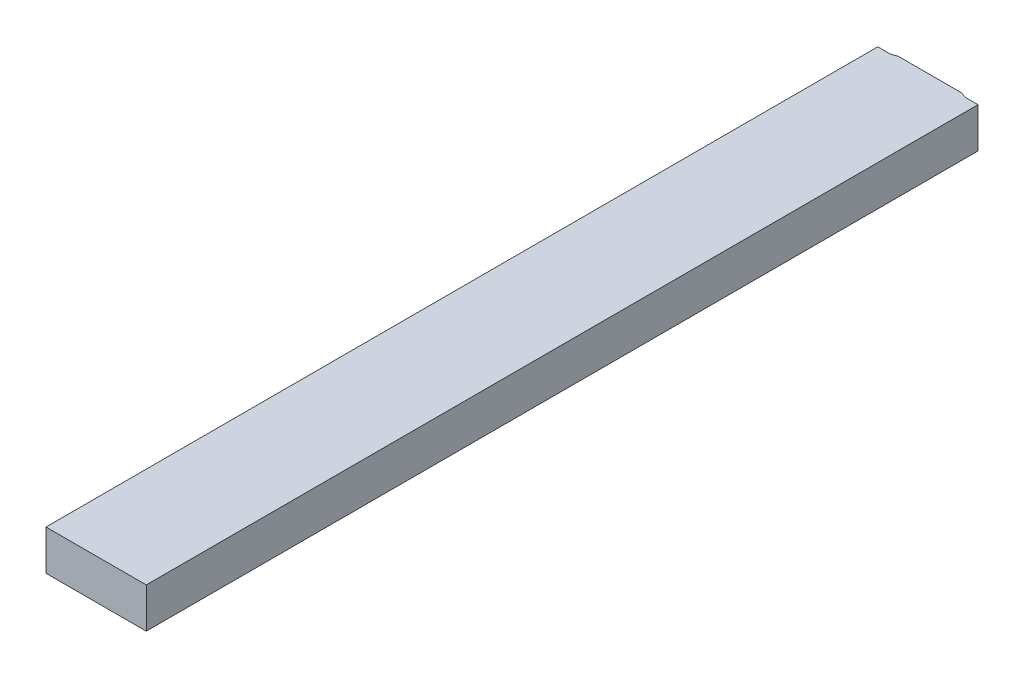
ISO-10303-21;
HEADER;
FILE_DESCRIPTION(('STEP AP214'),'2;1');
FILE_NAME('part.step','',(''),(''),'','','');
FILE_SCHEMA(('AUTOMOTIVE_DESIGN { 1 0 10303 214 1 1 1 1 }'));
ENDSEC;
DATA;
#1=APPLICATION_CONTEXT('core data for automotive mechanical design processes');
#2=APPLICATION_PROTOCOL_DEFINITION('international standard','automotive_design',2000,#1);
#3=PRODUCT_CONTEXT('',#1,'mechanical');
#4=PRODUCT('Part','Part','',(#3));
#5=PRODUCT_RELATED_PRODUCT_CATEGORY('part','',(#4));
#6=PRODUCT_DEFINITION_FORMATION('','',#4);
#7=PRODUCT_DEFINITION_CONTEXT('part definition',#1,'design');
#8=PRODUCT_DEFINITION('design','',#6,#7);
#9=PRODUCT_DEFINITION_SHAPE('','',#8);
#10=(LENGTH_UNIT() NAMED_UNIT(*) SI_UNIT(.MILLI.,.METRE.));
#11=(NAMED_UNIT(*) PLANE_ANGLE_UNIT() SI_UNIT($,.RADIAN.));
#12=(NAMED_UNIT(*) SI_UNIT($,.STERADIAN.) SOLID_ANGLE_UNIT());
#13=UNCERTAINTY_MEASURE_WITH_UNIT(LENGTH_MEASURE(1.E-05),#10,'distance_accuracy_value','');
#14=(GEOMETRIC_REPRESENTATION_CONTEXT(3) GLOBAL_UNCERTAINTY_ASSIGNED_CONTEXT((#13)) GLOBAL_UNIT_ASSIGNED_CONTEXT((#10,
#11,#12)) REPRESENTATION_CONTEXT('',''));
#15=CARTESIAN_POINT('',(0.,0.,0.));
#16=DIRECTION('',(0.,0.,1.));
#17=DIRECTION('',(1.,0.,0.));
#18=AXIS2_PLACEMENT_3D('',#15,#16,#17);
#19=CARTESIAN_POINT('',(-3.5,0.275,-4.982138483572));
#20=DIRECTION('',(0.,1.,0.));
#21=DIRECTION('',(0.,0.,1.));
#22=AXIS2_PLACEMENT_3D('',#19,#20,#21);
#23=PLANE('',#22);
#24=DIRECTION('',(1.,0.,0.));
#25=VECTOR('',#24,1.);
#26=CARTESIAN_POINT('',(-3.725,0.275,-7.051158663985));
#27=LINE('',#26,#25);
#28=CARTESIAN_POINT('',(-3.75,0.275,-7.051158663985));
#29=VERTEX_POINT('',#28);
#30=CARTESIAN_POINT('',(-3.69999999999826,0.275,-7.05115866398515));
#31=VERTEX_POINT('',#30);
#32=EDGE_CURVE('E184',#29,#31,#27,.T.);
#33=ORIENTED_EDGE('',*,*,#32,.T.);
#34=CARTESIAN_POINT('',(-3.66074390617903,0.275,-7.06145062487903));
#35=CARTESIAN_POINT('',(-3.66430562065387,0.275,-7.05943829430754));
#36=CARTESIAN_POINT('',(-3.66802308541288,0.275,-7.05770911016996));
#37=CARTESIAN_POINT('',(-3.675678668398,0.275,-7.05483826908998));
#38=CARTESIAN_POINT('',(-3.67961678669287,0.275,-7.05369661233063));
#39=CARTESIAN_POINT('',(-3.68899940611308,0.275,-7.05173413514556));
#40=CARTESIAN_POINT('',(-3.6944962200161,0.275,-7.05115865434742));
#41=CARTESIAN_POINT('',(-3.69999999999652,0.275,-7.0511586639853));
#42=B_SPLINE_CURVE_WITH_KNOTS('',3,(#34,#35,#36,#37,#38,#39,#40,#41),.UNSPECIFIED.,.F.,.F.,(4,2,
2,4),(0.,0.0122542009828671,0.0245084057837977,0.0409766482847963),.UNSPECIFIED.);
#43=CARTESIAN_POINT('',(-3.66074390617903,0.275,-7.06145062487903));
#44=VERTEX_POINT('',#43);
#45=EDGE_CURVE('E93',#44,#31,#42,.T.);
#46=ORIENTED_EDGE('',*,*,#45,.F.);
#47=DIRECTION('',(1.,0.,0.));
#48=VECTOR('',#47,1.);
#49=CARTESIAN_POINT('',(-3.499999951796,0.275,-7.061450624879));
#50=LINE('',#49,#48);
#51=CARTESIAN_POINT('',(-3.339255997412,0.275,-7.06145062487899));
#52=VERTEX_POINT('',#51);
#53=EDGE_CURVE('E89',#44,#52,#50,.T.);
#54=ORIENTED_EDGE('',*,*,#53,.T.);
#55=CARTESIAN_POINT('',(-3.30000000000351,0.275,-7.05115866398509));
#56=CARTESIAN_POINT('',(-3.30408879277278,0.275,-7.05116284562048));
#57=CARTESIAN_POINT('',(-3.30817611333355,0.275,-7.05148113218099));
#58=CARTESIAN_POINT('',(-3.31625667415824,0.275,-7.05273057454798));
#59=CARTESIAN_POINT('',(-3.32024989952299,0.275,-7.05366182674584));
#60=CARTESIAN_POINT('',(-3.32939082766556,0.275,-7.05654480111922));
#61=CARTESIAN_POINT('',(-3.33446335028937,0.275,-7.05873731135742));
#62=CARTESIAN_POINT('',(-3.339255997412,0.275,-7.06145062487899));
#63=B_SPLINE_CURVE_WITH_KNOTS('',3,(#55,#56,#57,#58,#59,#60,#61,#62),.UNSPECIFIED.,.F.,.F.,(4,2,
2,4),(0.,0.0122527379750514,0.0245074032044955,0.0409759652394006),.UNSPECIFIED.);
#64=CARTESIAN_POINT('',(-3.30000000000176,0.275,-7.05115866398504));
#65=VERTEX_POINT('',#64);
#66=EDGE_CURVE('E21',#65,#52,#63,.T.);
#67=ORIENTED_EDGE('',*,*,#66,.F.);
#68=DIRECTION('',(1.,0.,0.));
#69=VECTOR('',#68,1.);
#70=CARTESIAN_POINT('',(-3.275,0.275,-7.051158663985));
#71=LINE('',#70,#69);
#72=CARTESIAN_POINT('',(-3.25,0.275,-7.051158663985));
#73=VERTEX_POINT('',#72);
#74=EDGE_CURVE('E84',#65,#73,#71,.T.);
#75=ORIENTED_EDGE('',*,*,#74,.T.);
#76=DIRECTION('',(0.,0.,-1.));
#77=VECTOR('',#76,1.);
#78=CARTESIAN_POINT('',(-3.25,0.275,-4.976992503125));
#79=LINE('',#78,#77);
#80=CARTESIAN_POINT('',(-3.25,0.275,-2.902826342264));
#81=VERTEX_POINT('',#80);
#82=EDGE_CURVE('E218',#81,#73,#79,.T.);
#83=ORIENTED_EDGE('',*,*,#82,.F.);
#84=DIRECTION('',(1.,0.,0.));
#85=VECTOR('',#84,1.);
#86=CARTESIAN_POINT('',(-3.5,0.275,-2.902826342264));
#87=LINE('',#86,#85);
#88=CARTESIAN_POINT('',(-3.75,0.275,-2.902826342264));
#89=VERTEX_POINT('',#88);
#90=EDGE_CURVE('E204',#89,#81,#87,.T.);
#91=ORIENTED_EDGE('',*,*,#90,.F.);
#92=DIRECTION('',(0.,0.,-1.));
#93=VECTOR('',#92,1.);
#94=CARTESIAN_POINT('',(-3.75,0.275,-4.976992503125));
#95=LINE('',#94,#93);
#96=EDGE_CURVE('E176',#89,#29,#95,.T.);
#97=ORIENTED_EDGE('',*,*,#96,.T.);
#98=EDGE_LOOP('',(#33,#46,#54,#67,#75,#83,#91,#97));
#99=FACE_BOUND('',#98,.T.);
#100=ADVANCED_FACE('F17',(#99),#23,.F.);
#101=CARTESIAN_POINT('',(-3.25,0.375,-4.976992503125));
#102=DIRECTION('',(1.,0.,0.));
#103=DIRECTION('',(0.,0.,-1.));
#104=AXIS2_PLACEMENT_3D('',#101,#102,#103);
#105=PLANE('',#104);
#106=DIRECTION('',(0.,0.,1.));
#107=VECTOR('',#106,1.);
#108=CARTESIAN_POINT('',(-3.25,0.475,-4.982138483571));
#109=LINE('',#108,#107);
#110=CARTESIAN_POINT('',(-3.25,0.475,-2.902826342264));
#111=VERTEX_POINT('',#110);
#112=CARTESIAN_POINT('',(-3.25,0.475,-7.051158663985));
#113=VERTEX_POINT('',#112);
#114=EDGE_CURVE('E189',#111,#113,#109,.F.);
#115=ORIENTED_EDGE('',*,*,#114,.F.);
#116=DIRECTION('',(0.,1.,0.));
#117=VECTOR('',#116,1.);
#118=CARTESIAN_POINT('',(-3.25,0.375,-2.902826342264));
#119=LINE('',#118,#117);
#120=EDGE_CURVE('E203',#81,#111,#119,.T.);
#121=ORIENTED_EDGE('',*,*,#120,.F.);
#122=ORIENTED_EDGE('',*,*,#82,.T.);
#123=DIRECTION('',(0.,1.,0.));
#124=VECTOR('',#123,1.);
#125=CARTESIAN_POINT('',(-3.25,0.375,-7.051158663985));
#126=LINE('',#125,#124);
#127=EDGE_CURVE('E233',#73,#113,#126,.T.);
#128=ORIENTED_EDGE('',*,*,#127,.T.);
#129=EDGE_LOOP('',(#115,#121,#122,#128));
#130=FACE_BOUND('',#129,.T.);
#131=ADVANCED_FACE('F238',(#130),#105,.T.);
#132=CARTESIAN_POINT('',(-3.275,0.375,-7.051158663985));
#133=DIRECTION('',(0.,0.,1.));
#134=DIRECTION('',(1.,0.,0.));
#135=AXIS2_PLACEMENT_3D('',#132,#133,#134);
#136=PLANE('',#135);
#137=DIRECTION('',(1.,0.,0.));
#138=VECTOR('',#137,1.);
#139=CARTESIAN_POINT('',(-3.5,0.475,-7.051158663985));
#140=LINE('',#139,#138);
#141=CARTESIAN_POINT('',(-3.30000007335933,0.475,-7.05115866418437));
#142=VERTEX_POINT('',#141);
#143=EDGE_CURVE('E135',#113,#142,#140,.F.);
#144=ORIENTED_EDGE('',*,*,#143,.F.);
#145=ORIENTED_EDGE('',*,*,#127,.F.);
#146=ORIENTED_EDGE('',*,*,#74,.F.);
#147=DIRECTION('',(0.,1.,0.));
#148=VECTOR('',#147,1.);
#149=CARTESIAN_POINT('',(-3.3,0.2699679840491,-7.05115866398508));
#150=LINE('',#149,#148);
#151=EDGE_CURVE('E103',#142,#65,#150,.F.);
#152=ORIENTED_EDGE('',*,*,#151,.F.);
#153=EDGE_LOOP('',(#144,#145,#146,#152));
#154=FACE_BOUND('',#153,.T.);
#155=ADVANCED_FACE('F125',(#154),#136,.F.);
#156=CARTESIAN_POINT('',(-3.29748039058,0.2699679840491,-7.051190309039));
#157=CARTESIAN_POINT('',(-3.29831958238,0.2699679840491,-7.051166943388));
#158=CARTESIAN_POINT('',(-3.304384997637,0.2699679840491,-7.051090682037));
#159=CARTESIAN_POINT('',(-3.315708586206,0.2699679840491,-7.052195104335));
#160=CARTESIAN_POINT('',(-3.328858649665,0.2699679840491,-7.056177217872));
#161=CARTESIAN_POINT('',(-3.337975877851,0.2699679840491,-7.060613467733));
#162=CARTESIAN_POINT('',(-3.342157497933,0.2699679840491,-7.063145821386));
#163=CARTESIAN_POINT('',(-3.343566222697,0.2699679840491,-7.064061090588));
#164=(BOUNDED_CURVE() B_SPLINE_CURVE(3,(#156,#157,#158,#159,#160,#161,#162,#163),.UNSPECIFIED.,
.F.,.F.) B_SPLINE_CURVE_WITH_KNOTS((4,1,1,1,1,4),(0.,0.05196482602246,0.3752098129395,
0.6983604955075,0.8962889073999,1.),
.UNSPECIFIED.) CURVE() GEOMETRIC_REPRESENTATION_ITEM() RATIONAL_B_SPLINE_CURVE((1.,1.,1.,1.,1.,
1.,1.,1.)) REPRESENTATION_ITEM(''));
#165=DIRECTION('',(0.,1.,0.));
#166=VECTOR('',#165,1.);
#167=SURFACE_OF_LINEAR_EXTRUSION('',#164,#166);
#168=ORIENTED_EDGE('',*,*,#66,.T.);
#169=DIRECTION('',(0.,1.,0.));
#170=VECTOR('',#169,1.);
#171=CARTESIAN_POINT('',(-3.339255997412,0.375,-7.061450624879));
#172=LINE('',#171,#170);
#173=CARTESIAN_POINT('',(-3.339255997412,0.475,-7.061450624879));
#174=VERTEX_POINT('',#173);
#175=EDGE_CURVE('E97',#52,#174,#172,.T.);
#176=ORIENTED_EDGE('',*,*,#175,.T.);
#177=CARTESIAN_POINT('',(-3.30000014671866,0.475,-7.05115866438369));
#178=CARTESIAN_POINT('',(-3.30408893948173,0.475,-7.0511628532203));
#179=CARTESIAN_POINT('',(-3.30817625948793,0.475,-7.05148114713333));
#180=CARTESIAN_POINT('',(-3.3162568180645,0.475,-7.05273060421157));
#181=CARTESIAN_POINT('',(-3.3202500417355,0.475,-7.05366186376829));
#182=CARTESIAN_POINT('',(-3.32939091806165,0.475,-7.05654484039364));
#183=CARTESIAN_POINT('',(-3.33446339307278,0.475,-7.05873733584115));
#184=CARTESIAN_POINT('',(-3.339255997412,0.475,-7.06145062487899));
#185=B_SPLINE_CURVE_WITH_KNOTS('',3,(#177,#178,#179,#180,#181,#182,#183,#184),.UNSPECIFIED.,.F.,
.F.,(4,2,2,4),(0.,0.0122527379884831,0.0245074032339877,0.0409758193004652),.UNSPECIFIED.);
#186=EDGE_CURVE('E129',#142,#174,#185,.T.);
#187=ORIENTED_EDGE('',*,*,#186,.F.);
#188=ORIENTED_EDGE('',*,*,#151,.T.);
#189=EDGE_LOOP('',(#168,#176,#187,#188));
#190=FACE_BOUND('',#189,.T.);
#191=ADVANCED_FACE('F100',(#190),#167,.T.);
#192=CARTESIAN_POINT('',(-3.499999951796,0.375,-7.061450624879));
#193=DIRECTION('',(0.,0.,1.));
#194=DIRECTION('',(1.,0.,0.));
#195=AXIS2_PLACEMENT_3D('',#192,#193,#194);
#196=PLANE('',#195);
#197=ORIENTED_EDGE('',*,*,#53,.F.);
#198=DIRECTION('',(0.,1.,0.));
#199=VECTOR('',#198,1.);
#200=CARTESIAN_POINT('',(-3.66074390617902,0.2699679840491,-7.06145062487904));
#201=LINE('',#200,#199);
#202=CARTESIAN_POINT('',(-3.66074390617902,0.475,-7.06145062487903));
#203=VERTEX_POINT('',#202);
#204=EDGE_CURVE('E109',#203,#44,#201,.F.);
#205=ORIENTED_EDGE('',*,*,#204,.F.);
#206=DIRECTION('',(1.,0.,0.));
#207=VECTOR('',#206,1.);
#208=CARTESIAN_POINT('',(-3.5,0.475,-7.061450624879));
#209=LINE('',#208,#207);
#210=EDGE_CURVE('E106',#174,#203,#209,.F.);
#211=ORIENTED_EDGE('',*,*,#210,.F.);
#212=ORIENTED_EDGE('',*,*,#175,.F.);
#213=EDGE_LOOP('',(#197,#205,#211,#212));
#214=FACE_BOUND('',#213,.T.);
#215=ADVANCED_FACE('F104',(#214),#196,.F.);
#216=CARTESIAN_POINT('',(-3.656433692458,0.2699679840491,-7.064061118802));
#217=CARTESIAN_POINT('',(-3.65784241379,0.2699679840491,-7.063145841608));
#218=CARTESIAN_POINT('',(-3.662021892669,0.2699679840491,-7.060614746012));
#219=CARTESIAN_POINT('',(-3.67113801512,0.2699679840491,-7.056178456814));
#220=CARTESIAN_POINT('',(-3.684287959398,0.2699679840491,-7.052195755785));
#221=CARTESIAN_POINT('',(-3.695613253729,0.2699679840491,-7.051090694486));
#222=CARTESIAN_POINT('',(-3.701678868218,0.2699679840491,-7.051166937919));
#223=CARTESIAN_POINT('',(-3.702517288364,0.2699679840491,-7.051190272618));
#224=(BOUNDED_CURVE() B_SPLINE_CURVE(3,(#216,#217,#218,#219,#220,#221,#222,#223),.UNSPECIFIED.,
.F.,.F.) B_SPLINE_CURVE_WITH_KNOTS((4,1,1,1,1,4),(0.,0.1037158878781,0.3014998794713,
0.6247605212749,0.9480806664175,1.),
.UNSPECIFIED.) CURVE() GEOMETRIC_REPRESENTATION_ITEM() RATIONAL_B_SPLINE_CURVE((1.,1.,1.,1.,1.,
1.,1.,1.)) REPRESENTATION_ITEM(''));
#225=DIRECTION('',(0.,1.,0.));
#226=VECTOR('',#225,1.);
#227=SURFACE_OF_LINEAR_EXTRUSION('',#224,#226);
#228=CARTESIAN_POINT('',(-3.66074390617903,0.475,-7.06145062487904));
#229=CARTESIAN_POINT('',(-3.66430562063098,0.475,-7.05943829433274));
#230=CARTESIAN_POINT('',(-3.66802308540143,0.475,-7.05770911018256));
#231=CARTESIAN_POINT('',(-3.67567866840944,0.475,-7.05483826907738));
#232=CARTESIAN_POINT('',(-3.67961678671575,0.475,-7.05369661230544));
#233=CARTESIAN_POINT('',(-3.68899935836828,0.475,-7.05173414515934));
#234=CARTESIAN_POINT('',(-3.69449612238526,0.475,-7.05115866469184));
#235=CARTESIAN_POINT('',(-3.69999985318857,0.475,-7.05115866438328));
#236=B_SPLINE_CURVE_WITH_KNOTS('',3,(#228,#229,#230,#231,#232,#233,#234,#235),.UNSPECIFIED.,.F.,
.F.,(4,2,2,4),(0.,0.0122542009828672,0.024508405783798,0.0409765022206899),.UNSPECIFIED.);
#237=CARTESIAN_POINT('',(-3.7,0.475,-7.051158663985));
#238=VERTEX_POINT('',#237);
#239=EDGE_CURVE('E136',#203,#238,#236,.T.);
#240=ORIENTED_EDGE('',*,*,#239,.F.);
#241=ORIENTED_EDGE('',*,*,#204,.T.);
#242=ORIENTED_EDGE('',*,*,#45,.T.);
#243=DIRECTION('',(0.,1.,0.));
#244=VECTOR('',#243,1.);
#245=CARTESIAN_POINT('',(-3.7,0.375,-7.051158663985));
#246=LINE('',#245,#244);
#247=EDGE_CURVE('E182',#31,#238,#246,.T.);
#248=ORIENTED_EDGE('',*,*,#247,.T.);
#249=EDGE_LOOP('',(#240,#241,#242,#248));
#250=FACE_BOUND('',#249,.T.);
#251=ADVANCED_FACE('F159',(#250),#227,.T.);
#252=CARTESIAN_POINT('',(-3.725,0.375,-7.051158663985));
#253=DIRECTION('',(0.,0.,1.));
#254=DIRECTION('',(1.,0.,0.));
#255=AXIS2_PLACEMENT_3D('',#252,#253,#254);
#256=PLANE('',#255);
#257=DIRECTION('',(1.,0.,0.));
#258=VECTOR('',#257,1.);
#259=CARTESIAN_POINT('',(-3.5,0.475,-7.051158663985));
#260=LINE('',#259,#258);
#261=CARTESIAN_POINT('',(-3.75,0.475,-7.051158663985));
#262=VERTEX_POINT('',#261);
#263=EDGE_CURVE('E181',#238,#262,#260,.F.);
#264=ORIENTED_EDGE('',*,*,#263,.F.);
#265=ORIENTED_EDGE('',*,*,#247,.F.);
#266=ORIENTED_EDGE('',*,*,#32,.F.);
#267=DIRECTION('',(0.,1.,0.));
#268=VECTOR('',#267,1.);
#269=CARTESIAN_POINT('',(-3.75,0.375,-7.051158663985));
#270=LINE('',#269,#268);
#271=EDGE_CURVE('E174',#29,#262,#270,.T.);
#272=ORIENTED_EDGE('',*,*,#271,.T.);
#273=EDGE_LOOP('',(#264,#265,#266,#272));
#274=FACE_BOUND('',#273,.T.);
#275=ADVANCED_FACE('F157',(#274),#256,.F.);
#276=CARTESIAN_POINT('',(-3.75,0.375,-4.976992503125));
#277=DIRECTION('',(1.,0.,0.));
#278=DIRECTION('',(0.,0.,-1.));
#279=AXIS2_PLACEMENT_3D('',#276,#277,#278);
#280=PLANE('',#279);
#281=ORIENTED_EDGE('',*,*,#271,.F.);
#282=ORIENTED_EDGE('',*,*,#96,.F.);
#283=DIRECTION('',(0.,1.,0.));
#284=VECTOR('',#283,1.);
#285=CARTESIAN_POINT('',(-3.75,0.375,-2.902826342264));
#286=LINE('',#285,#284);
#287=CARTESIAN_POINT('',(-3.75,0.475,-2.902826342264));
#288=VERTEX_POINT('',#287);
#289=EDGE_CURVE('E40',#288,#89,#286,.F.);
#290=ORIENTED_EDGE('',*,*,#289,.F.);
#291=DIRECTION('',(0.,0.,1.));
#292=VECTOR('',#291,1.);
#293=CARTESIAN_POINT('',(-3.75,0.475,-4.982138483571));
#294=LINE('',#293,#292);
#295=EDGE_CURVE('E31',#262,#288,#294,.T.);
#296=ORIENTED_EDGE('',*,*,#295,.F.);
#297=EDGE_LOOP('',(#281,#282,#290,#296));
#298=FACE_BOUND('',#297,.T.);
#299=ADVANCED_FACE('F153',(#298),#280,.F.);
#300=CARTESIAN_POINT('',(-3.5,0.375,-2.902826342264));
#301=DIRECTION('',(0.,0.,1.));
#302=DIRECTION('',(1.,0.,0.));
#303=AXIS2_PLACEMENT_3D('',#300,#301,#302);
#304=PLANE('',#303);
#305=ORIENTED_EDGE('',*,*,#120,.T.);
#306=DIRECTION('',(1.,0.,0.));
#307=VECTOR('',#306,1.);
#308=CARTESIAN_POINT('',(-3.5,0.475,-2.902826342264));
#309=LINE('',#308,#307);
#310=EDGE_CURVE('E11',#288,#111,#309,.T.);
#311=ORIENTED_EDGE('',*,*,#310,.F.);
#312=ORIENTED_EDGE('',*,*,#289,.T.);
#313=ORIENTED_EDGE('',*,*,#90,.T.);
#314=EDGE_LOOP('',(#305,#311,#312,#313));
#315=FACE_BOUND('',#314,.T.);
#316=ADVANCED_FACE('F148',(#315),#304,.T.);
#317=CARTESIAN_POINT('',(-3.5,0.475,-4.982138483571));
#318=DIRECTION('',(0.,1.,0.));
#319=DIRECTION('',(0.,0.,1.));
#320=AXIS2_PLACEMENT_3D('',#317,#318,#319);
#321=PLANE('',#320);
#322=ORIENTED_EDGE('',*,*,#295,.T.);
#323=ORIENTED_EDGE('',*,*,#310,.T.);
#324=ORIENTED_EDGE('',*,*,#114,.T.);
#325=ORIENTED_EDGE('',*,*,#143,.T.);
#326=ORIENTED_EDGE('',*,*,#186,.T.);
#327=ORIENTED_EDGE('',*,*,#210,.T.);
#328=ORIENTED_EDGE('',*,*,#239,.T.);
#329=ORIENTED_EDGE('',*,*,#263,.T.);
#330=EDGE_LOOP('',(#322,#323,#324,#325,#326,#327,#328,#329));
#331=FACE_BOUND('',#330,.T.);
#332=ADVANCED_FACE('F144',(#331),#321,.T.);
#333=CLOSED_SHELL('',(#100,#131,#155,#191,#215,#251,#275,#299,#316,#332));
#334=MANIFOLD_SOLID_BREP('B1',#333);
#335=ADVANCED_BREP_SHAPE_REPRESENTATION('',(#18,#334),#14);
#336=SHAPE_DEFINITION_REPRESENTATION(#9,#335);
ENDSEC;
END-ISO-10303-21;
